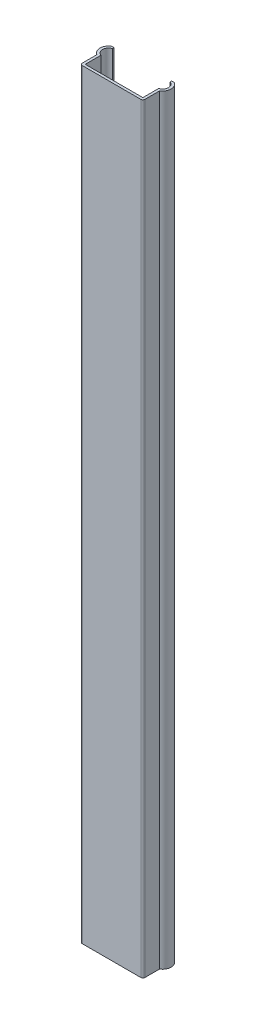
ISO-10303-21;
HEADER;
FILE_DESCRIPTION(('STEP AP214'),'2;1');
FILE_NAME('part.step','',(''),(''),'','','');
FILE_SCHEMA(('AUTOMOTIVE_DESIGN { 1 0 10303 214 1 1 1 1 }'));
ENDSEC;
DATA;
#1=APPLICATION_CONTEXT('core data for automotive mechanical design processes');
#2=APPLICATION_PROTOCOL_DEFINITION('international standard','automotive_design',2000,#1);
#3=PRODUCT_CONTEXT('',#1,'mechanical');
#4=PRODUCT('Part','Part','',(#3));
#5=PRODUCT_RELATED_PRODUCT_CATEGORY('part','',(#4));
#6=PRODUCT_DEFINITION_FORMATION('','',#4);
#7=PRODUCT_DEFINITION_CONTEXT('part definition',#1,'design');
#8=PRODUCT_DEFINITION('design','',#6,#7);
#9=PRODUCT_DEFINITION_SHAPE('','',#8);
#10=(LENGTH_UNIT() NAMED_UNIT(*) SI_UNIT(.MILLI.,.METRE.));
#11=(NAMED_UNIT(*) PLANE_ANGLE_UNIT() SI_UNIT($,.RADIAN.));
#12=(NAMED_UNIT(*) SI_UNIT($,.STERADIAN.) SOLID_ANGLE_UNIT());
#13=UNCERTAINTY_MEASURE_WITH_UNIT(LENGTH_MEASURE(1.E-05),#10,'distance_accuracy_value','');
#14=(GEOMETRIC_REPRESENTATION_CONTEXT(3) GLOBAL_UNCERTAINTY_ASSIGNED_CONTEXT((#13)) GLOBAL_UNIT_ASSIGNED_CONTEXT((#10,
#11,#12)) REPRESENTATION_CONTEXT('',''));
#15=CARTESIAN_POINT('',(0.,0.,0.));
#16=DIRECTION('',(0.,0.,1.));
#17=DIRECTION('',(1.,0.,0.));
#18=AXIS2_PLACEMENT_3D('',#15,#16,#17);
#19=CARTESIAN_POINT('',(-7.5,182.,0.));
#20=DIRECTION('',(1.,0.,0.));
#21=DIRECTION('',(0.,0.,-1.));
#22=AXIS2_PLACEMENT_3D('',#19,#20,#21);
#23=PLANE('',#22);
#24=DIRECTION('',(0.,0.,1.));
#25=VECTOR('',#24,1.);
#26=CARTESIAN_POINT('',(-7.5,0.,0.));
#27=LINE('',#26,#25);
#28=CARTESIAN_POINT('',(-7.5,0.,-4.));
#29=VERTEX_POINT('',#28);
#30=CARTESIAN_POINT('',(-7.5,0.,-0.499999999999999));
#31=VERTEX_POINT('',#30);
#32=EDGE_CURVE('E191',#29,#31,#27,.T.);
#33=ORIENTED_EDGE('',*,*,#32,.T.);
#34=DIRECTION('',(0.,-1.,0.));
#35=VECTOR('',#34,1.);
#36=CARTESIAN_POINT('',(-7.5,182.,-0.499999999999999));
#37=LINE('',#36,#35);
#38=CARTESIAN_POINT('',(-7.5,182.,-0.499999999999999));
#39=VERTEX_POINT('',#38);
#40=EDGE_CURVE('E54',#31,#39,#37,.F.);
#41=ORIENTED_EDGE('',*,*,#40,.T.);
#42=DIRECTION('',(0.,0.,1.));
#43=VECTOR('',#42,1.);
#44=CARTESIAN_POINT('',(-7.5,182.,0.));
#45=LINE('',#44,#43);
#46=CARTESIAN_POINT('',(-7.5,182.,-4.));
#47=VERTEX_POINT('',#46);
#48=EDGE_CURVE('E219',#47,#39,#45,.T.);
#49=ORIENTED_EDGE('',*,*,#48,.F.);
#50=DIRECTION('',(0.,-1.,0.));
#51=VECTOR('',#50,1.);
#52=CARTESIAN_POINT('',(-7.5,182.,-4.));
#53=LINE('',#52,#51);
#54=EDGE_CURVE('E190',#47,#29,#53,.T.);
#55=ORIENTED_EDGE('',*,*,#54,.T.);
#56=EDGE_LOOP('',(#33,#41,#49,#55));
#57=FACE_BOUND('',#56,.T.);
#58=ADVANCED_FACE('F31',(#57),#23,.F.);
#59=CARTESIAN_POINT('',(7.5,182.,0.));
#60=DIRECTION('',(0.,0.,-1.));
#61=DIRECTION('',(-1.,0.,0.));
#62=AXIS2_PLACEMENT_3D('',#59,#60,#61);
#63=PLANE('',#62);
#64=DIRECTION('',(1.,0.,0.));
#65=VECTOR('',#64,1.);
#66=CARTESIAN_POINT('',(7.5,182.,0.));
#67=LINE('',#66,#65);
#68=CARTESIAN_POINT('',(-7.,182.,0.));
#69=VERTEX_POINT('',#68);
#70=CARTESIAN_POINT('',(7.,182.,0.));
#71=VERTEX_POINT('',#70);
#72=EDGE_CURVE('E152',#69,#71,#67,.T.);
#73=ORIENTED_EDGE('',*,*,#72,.F.);
#74=DIRECTION('',(0.,-1.,0.));
#75=VECTOR('',#74,1.);
#76=CARTESIAN_POINT('',(-7.,182.,0.));
#77=LINE('',#76,#75);
#78=CARTESIAN_POINT('',(-7.,0.,0.));
#79=VERTEX_POINT('',#78);
#80=EDGE_CURVE('E251',#69,#79,#77,.T.);
#81=ORIENTED_EDGE('',*,*,#80,.T.);
#82=DIRECTION('',(1.,0.,0.));
#83=VECTOR('',#82,1.);
#84=CARTESIAN_POINT('',(7.5,0.,0.));
#85=LINE('',#84,#83);
#86=CARTESIAN_POINT('',(7.,0.,0.));
#87=VERTEX_POINT('',#86);
#88=EDGE_CURVE('E193',#79,#87,#85,.T.);
#89=ORIENTED_EDGE('',*,*,#88,.T.);
#90=DIRECTION('',(0.,-1.,0.));
#91=VECTOR('',#90,1.);
#92=CARTESIAN_POINT('',(7.,182.,0.));
#93=LINE('',#92,#91);
#94=EDGE_CURVE('E161',#87,#71,#93,.F.);
#95=ORIENTED_EDGE('',*,*,#94,.T.);
#96=EDGE_LOOP('',(#73,#81,#89,#95));
#97=FACE_BOUND('',#96,.T.);
#98=ADVANCED_FACE('F264',(#97),#63,.F.);
#99=CARTESIAN_POINT('',(7.5,182.,0.));
#100=DIRECTION('',(-1.,0.,0.));
#101=DIRECTION('',(0.,0.,1.));
#102=AXIS2_PLACEMENT_3D('',#99,#100,#101);
#103=PLANE('',#102);
#104=DIRECTION('',(0.,0.,-1.));
#105=VECTOR('',#104,1.);
#106=CARTESIAN_POINT('',(7.5,182.,0.));
#107=LINE('',#106,#105);
#108=CARTESIAN_POINT('',(7.5,182.,-0.499999999999999));
#109=VERTEX_POINT('',#108);
#110=CARTESIAN_POINT('',(7.5,182.,-4.));
#111=VERTEX_POINT('',#110);
#112=EDGE_CURVE('E144',#109,#111,#107,.T.);
#113=ORIENTED_EDGE('',*,*,#112,.F.);
#114=DIRECTION('',(0.,-1.,0.));
#115=VECTOR('',#114,1.);
#116=CARTESIAN_POINT('',(7.5,182.,-0.499999999999999));
#117=LINE('',#116,#115);
#118=CARTESIAN_POINT('',(7.5,0.,-0.499999999999999));
#119=VERTEX_POINT('',#118);
#120=EDGE_CURVE('E11',#109,#119,#117,.T.);
#121=ORIENTED_EDGE('',*,*,#120,.T.);
#122=DIRECTION('',(0.,0.,-1.));
#123=VECTOR('',#122,1.);
#124=CARTESIAN_POINT('',(7.5,0.,0.));
#125=LINE('',#124,#123);
#126=CARTESIAN_POINT('',(7.5,0.,-4.));
#127=VERTEX_POINT('',#126);
#128=EDGE_CURVE('E158',#119,#127,#125,.T.);
#129=ORIENTED_EDGE('',*,*,#128,.T.);
#130=DIRECTION('',(0.,-1.,0.));
#131=VECTOR('',#130,1.);
#132=CARTESIAN_POINT('',(7.5,182.,-4.));
#133=LINE('',#132,#131);
#134=EDGE_CURVE('E155',#111,#127,#133,.T.);
#135=ORIENTED_EDGE('',*,*,#134,.F.);
#136=EDGE_LOOP('',(#113,#121,#129,#135));
#137=FACE_BOUND('',#136,.T.);
#138=ADVANCED_FACE('F156',(#137),#103,.F.);
#139=CARTESIAN_POINT('',(6.46875,182.,-5.75));
#140=DIRECTION('',(0.,-1.,0.));
#141=DIRECTION('',(0.,0.,-1.));
#142=AXIS2_PLACEMENT_3D('',#139,#140,#141);
#143=CYLINDRICAL_SURFACE('',#142,2.03125);
#144=CARTESIAN_POINT('',(6.46875,0.,-5.75));
#145=DIRECTION('',(0.,1.,0.));
#146=DIRECTION('',(0.,0.,1.));
#147=AXIS2_PLACEMENT_3D('',#144,#145,#146);
#148=CIRCLE('',#147,2.03125);
#149=CARTESIAN_POINT('',(7.5,0.,-7.5));
#150=VERTEX_POINT('',#149);
#151=EDGE_CURVE('E197',#127,#150,#148,.T.);
#152=ORIENTED_EDGE('',*,*,#151,.T.);
#153=DIRECTION('',(0.,-1.,0.));
#154=VECTOR('',#153,1.);
#155=CARTESIAN_POINT('',(7.5,182.,-7.5));
#156=LINE('',#155,#154);
#157=CARTESIAN_POINT('',(7.5,182.,-7.5));
#158=VERTEX_POINT('',#157);
#159=EDGE_CURVE('E162',#158,#150,#156,.T.);
#160=ORIENTED_EDGE('',*,*,#159,.F.);
#161=CARTESIAN_POINT('',(6.46875,182.,-5.75));
#162=DIRECTION('',(0.,1.,0.));
#163=DIRECTION('',(0.,0.,1.));
#164=AXIS2_PLACEMENT_3D('',#161,#162,#163);
#165=CIRCLE('',#164,2.03125);
#166=EDGE_CURVE('E148',#111,#158,#165,.T.);
#167=ORIENTED_EDGE('',*,*,#166,.F.);
#168=ORIENTED_EDGE('',*,*,#134,.T.);
#169=EDGE_LOOP('',(#152,#160,#167,#168));
#170=FACE_BOUND('',#169,.T.);
#171=ADVANCED_FACE('F164',(#170),#143,.T.);
#172=CARTESIAN_POINT('',(7.5,182.,-7.5));
#173=DIRECTION('',(0.,0.,1.));
#174=DIRECTION('',(1.,0.,0.));
#175=AXIS2_PLACEMENT_3D('',#172,#173,#174);
#176=PLANE('',#175);
#177=DIRECTION('',(-1.,0.,0.));
#178=VECTOR('',#177,1.);
#179=CARTESIAN_POINT('',(7.5,0.,-7.5));
#180=LINE('',#179,#178);
#181=CARTESIAN_POINT('',(6.9,0.,-7.5));
#182=VERTEX_POINT('',#181);
#183=EDGE_CURVE('E199',#150,#182,#180,.T.);
#184=ORIENTED_EDGE('',*,*,#183,.T.);
#185=DIRECTION('',(0.,-1.,0.));
#186=VECTOR('',#185,1.);
#187=CARTESIAN_POINT('',(6.9,182.,-7.5));
#188=LINE('',#187,#186);
#189=CARTESIAN_POINT('',(6.9,182.,-7.5));
#190=VERTEX_POINT('',#189);
#191=EDGE_CURVE('E246',#190,#182,#188,.T.);
#192=ORIENTED_EDGE('',*,*,#191,.F.);
#193=DIRECTION('',(-1.,0.,0.));
#194=VECTOR('',#193,1.);
#195=CARTESIAN_POINT('',(7.5,182.,-7.5));
#196=LINE('',#195,#194);
#197=EDGE_CURVE('E167',#158,#190,#196,.T.);
#198=ORIENTED_EDGE('',*,*,#197,.F.);
#199=ORIENTED_EDGE('',*,*,#159,.T.);
#200=EDGE_LOOP('',(#184,#192,#198,#199));
#201=FACE_BOUND('',#200,.T.);
#202=ADVANCED_FACE('F319',(#201),#176,.F.);
#203=CARTESIAN_POINT('',(6.9,182.,-7.5));
#204=DIRECTION('',(1.,0.,0.));
#205=DIRECTION('',(0.,0.,-1.));
#206=AXIS2_PLACEMENT_3D('',#203,#204,#205);
#207=PLANE('',#206);
#208=DIRECTION('',(0.,0.,1.));
#209=VECTOR('',#208,1.);
#210=CARTESIAN_POINT('',(6.9,0.,-7.5));
#211=LINE('',#210,#209);
#212=CARTESIAN_POINT('',(6.9,0.,-7.11473440639562));
#213=VERTEX_POINT('',#212);
#214=EDGE_CURVE('E201',#182,#213,#211,.T.);
#215=ORIENTED_EDGE('',*,*,#214,.T.);
#216=DIRECTION('',(0.,-1.,0.));
#217=VECTOR('',#216,1.);
#218=CARTESIAN_POINT('',(6.9,182.,-7.11473440639562));
#219=LINE('',#218,#217);
#220=CARTESIAN_POINT('',(6.9,182.,-7.11473440639562));
#221=VERTEX_POINT('',#220);
#222=EDGE_CURVE('E243',#221,#213,#219,.T.);
#223=ORIENTED_EDGE('',*,*,#222,.F.);
#224=DIRECTION('',(0.,0.,1.));
#225=VECTOR('',#224,1.);
#226=CARTESIAN_POINT('',(6.9,182.,-7.5));
#227=LINE('',#226,#225);
#228=EDGE_CURVE('E169',#190,#221,#227,.T.);
#229=ORIENTED_EDGE('',*,*,#228,.F.);
#230=ORIENTED_EDGE('',*,*,#191,.T.);
#231=EDGE_LOOP('',(#215,#223,#229,#230));
#232=FACE_BOUND('',#231,.T.);
#233=ADVANCED_FACE('F316',(#232),#207,.F.);
#234=CARTESIAN_POINT('',(6.46875,182.,-5.75));
#235=DIRECTION('',(0.,-1.,0.));
#236=DIRECTION('',(0.,0.,-1.));
#237=AXIS2_PLACEMENT_3D('',#234,#235,#236);
#238=CYLINDRICAL_SURFACE('',#237,1.43125);
#239=CARTESIAN_POINT('',(6.46875,0.,-5.75));
#240=DIRECTION('',(0.,-1.,0.));
#241=DIRECTION('',(0.,0.,1.));
#242=AXIS2_PLACEMENT_3D('',#239,#240,#241);
#243=CIRCLE('',#242,1.43125);
#244=CARTESIAN_POINT('',(6.9,0.,-4.38526559360438));
#245=VERTEX_POINT('',#244);
#246=EDGE_CURVE('E203',#213,#245,#243,.T.);
#247=ORIENTED_EDGE('',*,*,#246,.T.);
#248=DIRECTION('',(0.,-1.,0.));
#249=VECTOR('',#248,1.);
#250=CARTESIAN_POINT('',(6.9,182.,-4.38526559360438));
#251=LINE('',#250,#249);
#252=CARTESIAN_POINT('',(6.9,182.,-4.38526559360438));
#253=VERTEX_POINT('',#252);
#254=EDGE_CURVE('E240',#253,#245,#251,.T.);
#255=ORIENTED_EDGE('',*,*,#254,.F.);
#256=CARTESIAN_POINT('',(6.46875,182.,-5.75));
#257=DIRECTION('',(0.,-1.,0.));
#258=DIRECTION('',(0.,0.,1.));
#259=AXIS2_PLACEMENT_3D('',#256,#257,#258);
#260=CIRCLE('',#259,1.43125);
#261=EDGE_CURVE('E174',#221,#253,#260,.T.);
#262=ORIENTED_EDGE('',*,*,#261,.F.);
#263=ORIENTED_EDGE('',*,*,#222,.T.);
#264=EDGE_LOOP('',(#247,#255,#262,#263));
#265=FACE_BOUND('',#264,.T.);
#266=ADVANCED_FACE('F311',(#265),#238,.F.);
#267=CARTESIAN_POINT('',(6.9,182.,-0.599999999999999));
#268=DIRECTION('',(1.,0.,0.));
#269=DIRECTION('',(0.,0.,-1.));
#270=AXIS2_PLACEMENT_3D('',#267,#268,#269);
#271=PLANE('',#270);
#272=DIRECTION('',(0.,0.,1.));
#273=VECTOR('',#272,1.);
#274=CARTESIAN_POINT('',(6.9,0.,-0.599999999999999));
#275=LINE('',#274,#273);
#276=CARTESIAN_POINT('',(6.9,0.,-0.599999999999999));
#277=VERTEX_POINT('',#276);
#278=EDGE_CURVE('E205',#245,#277,#275,.T.);
#279=ORIENTED_EDGE('',*,*,#278,.T.);
#280=DIRECTION('',(0.,-1.,0.));
#281=VECTOR('',#280,1.);
#282=CARTESIAN_POINT('',(6.9,182.,-0.599999999999999));
#283=LINE('',#282,#281);
#284=CARTESIAN_POINT('',(6.9,182.,-0.599999999999999));
#285=VERTEX_POINT('',#284);
#286=EDGE_CURVE('E237',#285,#277,#283,.T.);
#287=ORIENTED_EDGE('',*,*,#286,.F.);
#288=DIRECTION('',(0.,0.,1.));
#289=VECTOR('',#288,1.);
#290=CARTESIAN_POINT('',(6.9,182.,-0.599999999999999));
#291=LINE('',#290,#289);
#292=EDGE_CURVE('E176',#253,#285,#291,.T.);
#293=ORIENTED_EDGE('',*,*,#292,.F.);
#294=ORIENTED_EDGE('',*,*,#254,.T.);
#295=EDGE_LOOP('',(#279,#287,#293,#294));
#296=FACE_BOUND('',#295,.T.);
#297=ADVANCED_FACE('F305',(#296),#271,.F.);
#298=CARTESIAN_POINT('',(6.9,182.,-0.599999999999999));
#299=DIRECTION('',(0.,0.,1.));
#300=DIRECTION('',(1.,0.,0.));
#301=AXIS2_PLACEMENT_3D('',#298,#299,#300);
#302=PLANE('',#301);
#303=DIRECTION('',(-1.,0.,0.));
#304=VECTOR('',#303,1.);
#305=CARTESIAN_POINT('',(6.9,0.,-0.599999999999999));
#306=LINE('',#305,#304);
#307=CARTESIAN_POINT('',(-6.9,0.,-0.599999999999999));
#308=VERTEX_POINT('',#307);
#309=EDGE_CURVE('E207',#277,#308,#306,.T.);
#310=ORIENTED_EDGE('',*,*,#309,.T.);
#311=DIRECTION('',(0.,-1.,0.));
#312=VECTOR('',#311,1.);
#313=CARTESIAN_POINT('',(-6.9,182.,-0.599999999999999));
#314=LINE('',#313,#312);
#315=CARTESIAN_POINT('',(-6.9,182.,-0.599999999999999));
#316=VERTEX_POINT('',#315);
#317=EDGE_CURVE('E234',#316,#308,#314,.T.);
#318=ORIENTED_EDGE('',*,*,#317,.F.);
#319=DIRECTION('',(-1.,0.,0.));
#320=VECTOR('',#319,1.);
#321=CARTESIAN_POINT('',(6.9,182.,-0.599999999999999));
#322=LINE('',#321,#320);
#323=EDGE_CURVE('E178',#285,#316,#322,.T.);
#324=ORIENTED_EDGE('',*,*,#323,.F.);
#325=ORIENTED_EDGE('',*,*,#286,.T.);
#326=EDGE_LOOP('',(#310,#318,#324,#325));
#327=FACE_BOUND('',#326,.T.);
#328=ADVANCED_FACE('F301',(#327),#302,.F.);
#329=CARTESIAN_POINT('',(-6.9,182.,-0.599999999999999));
#330=DIRECTION('',(-1.,0.,0.));
#331=DIRECTION('',(0.,0.,1.));
#332=AXIS2_PLACEMENT_3D('',#329,#330,#331);
#333=PLANE('',#332);
#334=DIRECTION('',(0.,0.,-1.));
#335=VECTOR('',#334,1.);
#336=CARTESIAN_POINT('',(-6.9,0.,-0.599999999999999));
#337=LINE('',#336,#335);
#338=CARTESIAN_POINT('',(-6.9,0.,-4.38526559360438));
#339=VERTEX_POINT('',#338);
#340=EDGE_CURVE('E209',#308,#339,#337,.T.);
#341=ORIENTED_EDGE('',*,*,#340,.T.);
#342=DIRECTION('',(0.,-1.,0.));
#343=VECTOR('',#342,1.);
#344=CARTESIAN_POINT('',(-6.9,182.,-4.38526559360438));
#345=LINE('',#344,#343);
#346=CARTESIAN_POINT('',(-6.9,182.,-4.38526559360438));
#347=VERTEX_POINT('',#346);
#348=EDGE_CURVE('E231',#347,#339,#345,.T.);
#349=ORIENTED_EDGE('',*,*,#348,.F.);
#350=DIRECTION('',(0.,0.,-1.));
#351=VECTOR('',#350,1.);
#352=CARTESIAN_POINT('',(-6.9,182.,-0.599999999999999));
#353=LINE('',#352,#351);
#354=EDGE_CURVE('E180',#316,#347,#353,.T.);
#355=ORIENTED_EDGE('',*,*,#354,.F.);
#356=ORIENTED_EDGE('',*,*,#317,.T.);
#357=EDGE_LOOP('',(#341,#349,#355,#356));
#358=FACE_BOUND('',#357,.T.);
#359=ADVANCED_FACE('F296',(#358),#333,.F.);
#360=CARTESIAN_POINT('',(-6.46875,182.,-5.75));
#361=DIRECTION('',(0.,-1.,0.));
#362=DIRECTION('',(0.,0.,-1.));
#363=AXIS2_PLACEMENT_3D('',#360,#361,#362);
#364=CYLINDRICAL_SURFACE('',#363,1.43125);
#365=CARTESIAN_POINT('',(-6.46875,0.,-5.75));
#366=DIRECTION('',(0.,-1.,0.));
#367=DIRECTION('',(0.,0.,-1.));
#368=AXIS2_PLACEMENT_3D('',#365,#366,#367);
#369=CIRCLE('',#368,1.43125);
#370=CARTESIAN_POINT('',(-6.9,0.,-7.11473440639562));
#371=VERTEX_POINT('',#370);
#372=EDGE_CURVE('E211',#339,#371,#369,.T.);
#373=ORIENTED_EDGE('',*,*,#372,.T.);
#374=DIRECTION('',(0.,-1.,0.));
#375=VECTOR('',#374,1.);
#376=CARTESIAN_POINT('',(-6.9,182.,-7.11473440639562));
#377=LINE('',#376,#375);
#378=CARTESIAN_POINT('',(-6.9,182.,-7.11473440639562));
#379=VERTEX_POINT('',#378);
#380=EDGE_CURVE('E228',#379,#371,#377,.T.);
#381=ORIENTED_EDGE('',*,*,#380,.F.);
#382=CARTESIAN_POINT('',(-6.46875,182.,-5.75));
#383=DIRECTION('',(0.,-1.,0.));
#384=DIRECTION('',(0.,0.,-1.));
#385=AXIS2_PLACEMENT_3D('',#382,#383,#384);
#386=CIRCLE('',#385,1.43125);
#387=EDGE_CURVE('E182',#347,#379,#386,.T.);
#388=ORIENTED_EDGE('',*,*,#387,.F.);
#389=ORIENTED_EDGE('',*,*,#348,.T.);
#390=EDGE_LOOP('',(#373,#381,#388,#389));
#391=FACE_BOUND('',#390,.T.);
#392=ADVANCED_FACE('F290',(#391),#364,.F.);
#393=CARTESIAN_POINT('',(-6.9,182.,-7.5));
#394=DIRECTION('',(-1.,0.,0.));
#395=DIRECTION('',(0.,0.,1.));
#396=AXIS2_PLACEMENT_3D('',#393,#394,#395);
#397=PLANE('',#396);
#398=DIRECTION('',(0.,0.,-1.));
#399=VECTOR('',#398,1.);
#400=CARTESIAN_POINT('',(-6.9,0.,-7.5));
#401=LINE('',#400,#399);
#402=CARTESIAN_POINT('',(-6.9,0.,-7.5));
#403=VERTEX_POINT('',#402);
#404=EDGE_CURVE('E213',#371,#403,#401,.T.);
#405=ORIENTED_EDGE('',*,*,#404,.T.);
#406=DIRECTION('',(0.,-1.,0.));
#407=VECTOR('',#406,1.);
#408=CARTESIAN_POINT('',(-6.9,182.,-7.5));
#409=LINE('',#408,#407);
#410=CARTESIAN_POINT('',(-6.9,182.,-7.5));
#411=VERTEX_POINT('',#410);
#412=EDGE_CURVE('E225',#411,#403,#409,.T.);
#413=ORIENTED_EDGE('',*,*,#412,.F.);
#414=DIRECTION('',(0.,0.,-1.));
#415=VECTOR('',#414,1.);
#416=CARTESIAN_POINT('',(-6.9,182.,-7.5));
#417=LINE('',#416,#415);
#418=EDGE_CURVE('E184',#379,#411,#417,.T.);
#419=ORIENTED_EDGE('',*,*,#418,.F.);
#420=ORIENTED_EDGE('',*,*,#380,.T.);
#421=EDGE_LOOP('',(#405,#413,#419,#420));
#422=FACE_BOUND('',#421,.T.);
#423=ADVANCED_FACE('F286',(#422),#397,.F.);
#424=CARTESIAN_POINT('',(-7.5,182.,-7.5));
#425=DIRECTION('',(0.,0.,1.));
#426=DIRECTION('',(1.,0.,0.));
#427=AXIS2_PLACEMENT_3D('',#424,#425,#426);
#428=PLANE('',#427);
#429=DIRECTION('',(-1.,0.,0.));
#430=VECTOR('',#429,1.);
#431=CARTESIAN_POINT('',(-7.5,0.,-7.5));
#432=LINE('',#431,#430);
#433=CARTESIAN_POINT('',(-7.5,0.,-7.5));
#434=VERTEX_POINT('',#433);
#435=EDGE_CURVE('E215',#403,#434,#432,.T.);
#436=ORIENTED_EDGE('',*,*,#435,.T.);
#437=DIRECTION('',(0.,-1.,0.));
#438=VECTOR('',#437,1.);
#439=CARTESIAN_POINT('',(-7.5,182.,-7.5));
#440=LINE('',#439,#438);
#441=CARTESIAN_POINT('',(-7.5,182.,-7.5));
#442=VERTEX_POINT('',#441);
#443=EDGE_CURVE('E222',#442,#434,#440,.T.);
#444=ORIENTED_EDGE('',*,*,#443,.F.);
#445=DIRECTION('',(-1.,0.,0.));
#446=VECTOR('',#445,1.);
#447=CARTESIAN_POINT('',(-7.5,182.,-7.5));
#448=LINE('',#447,#446);
#449=EDGE_CURVE('E186',#411,#442,#448,.T.);
#450=ORIENTED_EDGE('',*,*,#449,.F.);
#451=ORIENTED_EDGE('',*,*,#412,.T.);
#452=EDGE_LOOP('',(#436,#444,#450,#451));
#453=FACE_BOUND('',#452,.T.);
#454=ADVANCED_FACE('F281',(#453),#428,.F.);
#455=CARTESIAN_POINT('',(-6.46875,182.,-5.75));
#456=DIRECTION('',(0.,-1.,0.));
#457=DIRECTION('',(0.,0.,-1.));
#458=AXIS2_PLACEMENT_3D('',#455,#456,#457);
#459=CYLINDRICAL_SURFACE('',#458,2.03125);
#460=CARTESIAN_POINT('',(-6.46875,0.,-5.75));
#461=DIRECTION('',(0.,1.,0.));
#462=DIRECTION('',(0.,0.,-1.));
#463=AXIS2_PLACEMENT_3D('',#460,#461,#462);
#464=CIRCLE('',#463,2.03125);
#465=EDGE_CURVE('E217',#434,#29,#464,.T.);
#466=ORIENTED_EDGE('',*,*,#465,.T.);
#467=ORIENTED_EDGE('',*,*,#54,.F.);
#468=CARTESIAN_POINT('',(-6.46875,182.,-5.75));
#469=DIRECTION('',(0.,1.,0.));
#470=DIRECTION('',(0.,0.,-1.));
#471=AXIS2_PLACEMENT_3D('',#468,#469,#470);
#472=CIRCLE('',#471,2.03125);
#473=EDGE_CURVE('E188',#442,#47,#472,.T.);
#474=ORIENTED_EDGE('',*,*,#473,.F.);
#475=ORIENTED_EDGE('',*,*,#443,.T.);
#476=EDGE_LOOP('',(#466,#467,#474,#475));
#477=FACE_BOUND('',#476,.T.);
#478=ADVANCED_FACE('F275',(#477),#459,.T.);
#479=CARTESIAN_POINT('',(-6.46875,182.,-5.75));
#480=DIRECTION('',(0.,-1.,0.));
#481=DIRECTION('',(0.,0.,-1.));
#482=AXIS2_PLACEMENT_3D('',#479,#480,#481);
#483=PLANE('',#482);
#484=ORIENTED_EDGE('',*,*,#48,.T.);
#485=CARTESIAN_POINT('',(-7.,182.,-0.499999999999999));
#486=DIRECTION('',(0.,-1.,0.));
#487=DIRECTION('',(0.,0.,-1.));
#488=AXIS2_PLACEMENT_3D('',#485,#486,#487);
#489=CIRCLE('',#488,0.5);
#490=EDGE_CURVE('E39',#39,#69,#489,.F.);
#491=ORIENTED_EDGE('',*,*,#490,.T.);
#492=ORIENTED_EDGE('',*,*,#72,.T.);
#493=CARTESIAN_POINT('',(7.,182.,-0.499999999999999));
#494=DIRECTION('',(0.,-1.,0.));
#495=DIRECTION('',(0.,0.,-1.));
#496=AXIS2_PLACEMENT_3D('',#493,#494,#495);
#497=CIRCLE('',#496,0.5);
#498=EDGE_CURVE('E46',#71,#109,#497,.F.);
#499=ORIENTED_EDGE('',*,*,#498,.T.);
#500=ORIENTED_EDGE('',*,*,#112,.T.);
#501=ORIENTED_EDGE('',*,*,#166,.T.);
#502=ORIENTED_EDGE('',*,*,#197,.T.);
#503=ORIENTED_EDGE('',*,*,#228,.T.);
#504=ORIENTED_EDGE('',*,*,#261,.T.);
#505=ORIENTED_EDGE('',*,*,#292,.T.);
#506=ORIENTED_EDGE('',*,*,#323,.T.);
#507=ORIENTED_EDGE('',*,*,#354,.T.);
#508=ORIENTED_EDGE('',*,*,#387,.T.);
#509=ORIENTED_EDGE('',*,*,#418,.T.);
#510=ORIENTED_EDGE('',*,*,#449,.T.);
#511=ORIENTED_EDGE('',*,*,#473,.T.);
#512=EDGE_LOOP('',(#484,#491,#492,#499,#500,#501,#502,#503,#504,#505,#506,#507,#508,#509,#510,#511));
#513=FACE_BOUND('',#512,.T.);
#514=ADVANCED_FACE('F146',(#513),#483,.F.);
#515=CARTESIAN_POINT('',(-6.46875,0.,-5.75));
#516=DIRECTION('',(0.,-1.,0.));
#517=DIRECTION('',(0.,0.,-1.));
#518=AXIS2_PLACEMENT_3D('',#515,#516,#517);
#519=PLANE('',#518);
#520=ORIENTED_EDGE('',*,*,#88,.F.);
#521=CARTESIAN_POINT('',(-7.,0.,-0.499999999999999));
#522=DIRECTION('',(0.,-1.,0.));
#523=DIRECTION('',(0.,0.,-1.));
#524=AXIS2_PLACEMENT_3D('',#521,#522,#523);
#525=CIRCLE('',#524,0.5);
#526=EDGE_CURVE('E256',#79,#31,#525,.T.);
#527=ORIENTED_EDGE('',*,*,#526,.T.);
#528=ORIENTED_EDGE('',*,*,#32,.F.);
#529=ORIENTED_EDGE('',*,*,#465,.F.);
#530=ORIENTED_EDGE('',*,*,#435,.F.);
#531=ORIENTED_EDGE('',*,*,#404,.F.);
#532=ORIENTED_EDGE('',*,*,#372,.F.);
#533=ORIENTED_EDGE('',*,*,#340,.F.);
#534=ORIENTED_EDGE('',*,*,#309,.F.);
#535=ORIENTED_EDGE('',*,*,#278,.F.);
#536=ORIENTED_EDGE('',*,*,#246,.F.);
#537=ORIENTED_EDGE('',*,*,#214,.F.);
#538=ORIENTED_EDGE('',*,*,#183,.F.);
#539=ORIENTED_EDGE('',*,*,#151,.F.);
#540=ORIENTED_EDGE('',*,*,#128,.F.);
#541=CARTESIAN_POINT('',(7.,0.,-0.499999999999999));
#542=DIRECTION('',(0.,-1.,0.));
#543=DIRECTION('',(0.,0.,-1.));
#544=AXIS2_PLACEMENT_3D('',#541,#542,#543);
#545=CIRCLE('',#544,0.5);
#546=EDGE_CURVE('E254',#119,#87,#545,.T.);
#547=ORIENTED_EDGE('',*,*,#546,.T.);
#548=EDGE_LOOP('',(#520,#527,#528,#529,#530,#531,#532,#533,#534,#535,#536,#537,#538,#539,#540,#547));
#549=FACE_BOUND('',#548,.T.);
#550=ADVANCED_FACE('F270',(#549),#519,.T.);
#551=CARTESIAN_POINT('',(-7.,182.,-0.499999999999999));
#552=DIRECTION('',(0.,-1.,0.));
#553=DIRECTION('',(0.,0.,-1.));
#554=AXIS2_PLACEMENT_3D('',#551,#552,#553);
#555=CYLINDRICAL_SURFACE('',#554,0.5);
#556=ORIENTED_EDGE('',*,*,#490,.F.);
#557=ORIENTED_EDGE('',*,*,#40,.F.);
#558=ORIENTED_EDGE('',*,*,#526,.F.);
#559=ORIENTED_EDGE('',*,*,#80,.F.);
#560=EDGE_LOOP('',(#556,#557,#558,#559));
#561=FACE_BOUND('',#560,.T.);
#562=ADVANCED_FACE('F267',(#561),#555,.T.);
#563=CARTESIAN_POINT('',(7.,182.,-0.499999999999999));
#564=DIRECTION('',(0.,-1.,0.));
#565=DIRECTION('',(0.,0.,-1.));
#566=AXIS2_PLACEMENT_3D('',#563,#564,#565);
#567=CYLINDRICAL_SURFACE('',#566,0.5);
#568=ORIENTED_EDGE('',*,*,#498,.F.);
#569=ORIENTED_EDGE('',*,*,#94,.F.);
#570=ORIENTED_EDGE('',*,*,#546,.F.);
#571=ORIENTED_EDGE('',*,*,#120,.F.);
#572=EDGE_LOOP('',(#568,#569,#570,#571));
#573=FACE_BOUND('',#572,.T.);
#574=ADVANCED_FACE('F33',(#573),#567,.T.);
#575=CLOSED_SHELL('',(#58,#98,#138,#171,#202,#233,#266,#297,#328,#359,#392,#423,#454,#478,#514,
#550,#562,#574));
#576=MANIFOLD_SOLID_BREP('B2',#575);
#577=ADVANCED_BREP_SHAPE_REPRESENTATION('',(#18,#576),#14);
#578=SHAPE_DEFINITION_REPRESENTATION(#9,#577);
ENDSEC;
END-ISO-10303-21;
